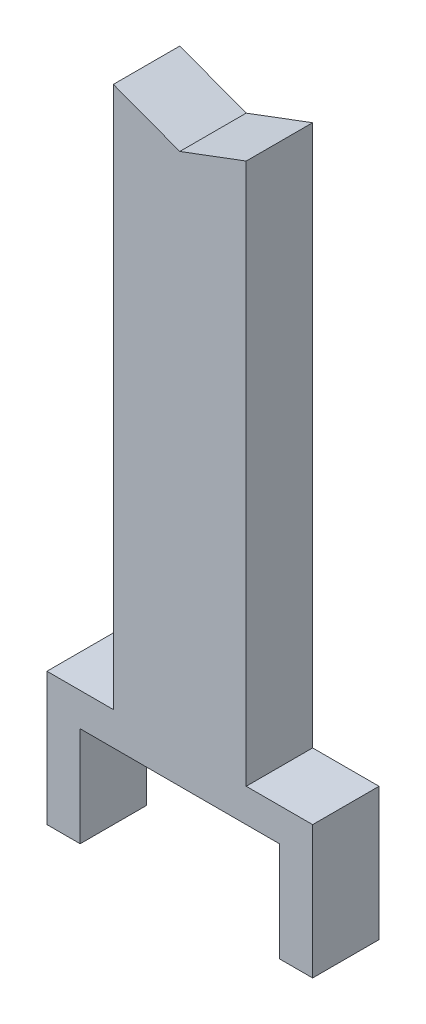
ISO-10303-21;
HEADER;
FILE_DESCRIPTION(('STEP AP214'),'2;1');
FILE_NAME('part.step','',(''),(''),'','','');
FILE_SCHEMA(('AUTOMOTIVE_DESIGN { 1 0 10303 214 1 1 1 1 }'));
ENDSEC;
DATA;
#1=APPLICATION_CONTEXT('core data for automotive mechanical design processes');
#2=APPLICATION_PROTOCOL_DEFINITION('international standard','automotive_design',2000,#1);
#3=PRODUCT_CONTEXT('',#1,'mechanical');
#4=PRODUCT('Part','Part','',(#3));
#5=PRODUCT_RELATED_PRODUCT_CATEGORY('part','',(#4));
#6=PRODUCT_DEFINITION_FORMATION('','',#4);
#7=PRODUCT_DEFINITION_CONTEXT('part definition',#1,'design');
#8=PRODUCT_DEFINITION('design','',#6,#7);
#9=PRODUCT_DEFINITION_SHAPE('','',#8);
#10=(LENGTH_UNIT() NAMED_UNIT(*) SI_UNIT(.MILLI.,.METRE.));
#11=(NAMED_UNIT(*) PLANE_ANGLE_UNIT() SI_UNIT($,.RADIAN.));
#12=(NAMED_UNIT(*) SI_UNIT($,.STERADIAN.) SOLID_ANGLE_UNIT());
#13=UNCERTAINTY_MEASURE_WITH_UNIT(LENGTH_MEASURE(1.E-05),#10,'distance_accuracy_value','');
#14=(GEOMETRIC_REPRESENTATION_CONTEXT(3) GLOBAL_UNCERTAINTY_ASSIGNED_CONTEXT((#13)) GLOBAL_UNIT_ASSIGNED_CONTEXT((#10,
#11,#12)) REPRESENTATION_CONTEXT('',''));
#15=CARTESIAN_POINT('',(0.,0.,0.));
#16=DIRECTION('',(0.,0.,1.));
#17=DIRECTION('',(1.,0.,0.));
#18=AXIS2_PLACEMENT_3D('',#15,#16,#17);
#19=CARTESIAN_POINT('',(0.,76.2,25.4));
#20=DIRECTION('',(0.,1.,0.));
#21=DIRECTION('',(-1.,0.,0.));
#22=AXIS2_PLACEMENT_3D('',#19,#20,#21);
#23=PLANE('',#22);
#24=DIRECTION('',(1.,0.,0.));
#25=VECTOR('',#24,1.);
#26=CARTESIAN_POINT('',(0.,76.2,-25.4));
#27=LINE('',#26,#25);
#28=CARTESIAN_POINT('',(-76.1999999999999,76.2,-25.4));
#29=VERTEX_POINT('',#28);
#30=CARTESIAN_POINT('',(76.2,76.2,-25.4));
#31=VERTEX_POINT('',#30);
#32=EDGE_CURVE('E174',#29,#31,#27,.T.);
#33=ORIENTED_EDGE('',*,*,#32,.T.);
#34=DIRECTION('',(0.,0.,-1.));
#35=VECTOR('',#34,1.);
#36=CARTESIAN_POINT('',(76.2,76.2,25.4));
#37=LINE('',#36,#35);
#38=CARTESIAN_POINT('',(76.2,76.2,25.4));
#39=VERTEX_POINT('',#38);
#40=EDGE_CURVE('E11',#39,#31,#37,.T.);
#41=ORIENTED_EDGE('',*,*,#40,.F.);
#42=DIRECTION('',(1.,0.,0.));
#43=VECTOR('',#42,1.);
#44=CARTESIAN_POINT('',(0.,76.2,25.4));
#45=LINE('',#44,#43);
#46=CARTESIAN_POINT('',(-76.1999999999999,76.2,25.4));
#47=VERTEX_POINT('',#46);
#48=EDGE_CURVE('E113',#47,#39,#45,.T.);
#49=ORIENTED_EDGE('',*,*,#48,.F.);
#50=DIRECTION('',(0.,0.,-1.));
#51=VECTOR('',#50,1.);
#52=CARTESIAN_POINT('',(-76.1999999999999,76.2,25.4));
#53=LINE('',#52,#51);
#54=EDGE_CURVE('E170',#47,#29,#53,.T.);
#55=ORIENTED_EDGE('',*,*,#54,.T.);
#56=EDGE_LOOP('',(#33,#41,#49,#55));
#57=FACE_BOUND('',#56,.T.);
#58=ADVANCED_FACE('F45',(#57),#23,.F.);
#59=CARTESIAN_POINT('',(76.2,0.,25.4));
#60=DIRECTION('',(-1.,0.,0.));
#61=DIRECTION('',(0.,-1.,0.));
#62=AXIS2_PLACEMENT_3D('',#59,#60,#61);
#63=PLANE('',#62);
#64=DIRECTION('',(0.,1.,0.));
#65=VECTOR('',#64,1.);
#66=CARTESIAN_POINT('',(76.2,0.,-25.4));
#67=LINE('',#66,#65);
#68=CARTESIAN_POINT('',(76.2,0.,-25.4));
#69=VERTEX_POINT('',#68);
#70=EDGE_CURVE('E178',#69,#31,#67,.T.);
#71=ORIENTED_EDGE('',*,*,#70,.F.);
#72=DIRECTION('',(0.,0.,-1.));
#73=VECTOR('',#72,1.);
#74=CARTESIAN_POINT('',(76.2,0.,25.4));
#75=LINE('',#74,#73);
#76=CARTESIAN_POINT('',(76.2,0.,25.4));
#77=VERTEX_POINT('',#76);
#78=EDGE_CURVE('E54',#77,#69,#75,.T.);
#79=ORIENTED_EDGE('',*,*,#78,.F.);
#80=DIRECTION('',(0.,1.,0.));
#81=VECTOR('',#80,1.);
#82=CARTESIAN_POINT('',(76.2,0.,25.4));
#83=LINE('',#82,#81);
#84=EDGE_CURVE('E263',#77,#39,#83,.T.);
#85=ORIENTED_EDGE('',*,*,#84,.T.);
#86=ORIENTED_EDGE('',*,*,#40,.T.);
#87=EDGE_LOOP('',(#71,#79,#85,#86));
#88=FACE_BOUND('',#87,.T.);
#89=ADVANCED_FACE('F262',(#88),#63,.T.);
#90=CARTESIAN_POINT('',(0.,0.,25.4));
#91=DIRECTION('',(0.,1.,0.));
#92=DIRECTION('',(-1.,0.,0.));
#93=AXIS2_PLACEMENT_3D('',#90,#91,#92);
#94=PLANE('',#93);
#95=DIRECTION('',(1.,0.,0.));
#96=VECTOR('',#95,1.);
#97=CARTESIAN_POINT('',(0.,0.,-25.4));
#98=LINE('',#97,#96);
#99=CARTESIAN_POINT('',(101.6,0.,-25.4));
#100=VERTEX_POINT('',#99);
#101=EDGE_CURVE('E182',#69,#100,#98,.T.);
#102=ORIENTED_EDGE('',*,*,#101,.T.);
#103=DIRECTION('',(0.,0.,-1.));
#104=VECTOR('',#103,1.);
#105=CARTESIAN_POINT('',(101.6,0.,25.4));
#106=LINE('',#105,#104);
#107=CARTESIAN_POINT('',(101.6,0.,25.4));
#108=VERTEX_POINT('',#107);
#109=EDGE_CURVE('E244',#108,#100,#106,.T.);
#110=ORIENTED_EDGE('',*,*,#109,.F.);
#111=DIRECTION('',(1.,0.,0.));
#112=VECTOR('',#111,1.);
#113=CARTESIAN_POINT('',(0.,0.,25.4));
#114=LINE('',#113,#112);
#115=EDGE_CURVE('E253',#77,#108,#114,.T.);
#116=ORIENTED_EDGE('',*,*,#115,.F.);
#117=ORIENTED_EDGE('',*,*,#78,.T.);
#118=EDGE_LOOP('',(#102,#110,#116,#117));
#119=FACE_BOUND('',#118,.T.);
#120=ADVANCED_FACE('F251',(#119),#94,.F.);
#121=CARTESIAN_POINT('',(101.6,0.,25.4));
#122=DIRECTION('',(-1.,0.,0.));
#123=DIRECTION('',(0.,-1.,0.));
#124=AXIS2_PLACEMENT_3D('',#121,#122,#123);
#125=PLANE('',#124);
#126=DIRECTION('',(0.,1.,0.));
#127=VECTOR('',#126,1.);
#128=CARTESIAN_POINT('',(101.6,0.,-25.4));
#129=LINE('',#128,#127);
#130=CARTESIAN_POINT('',(101.6,101.6,-25.4));
#131=VERTEX_POINT('',#130);
#132=EDGE_CURVE('E185',#100,#131,#129,.T.);
#133=ORIENTED_EDGE('',*,*,#132,.T.);
#134=DIRECTION('',(0.,0.,-1.));
#135=VECTOR('',#134,1.);
#136=CARTESIAN_POINT('',(101.6,101.6,25.4));
#137=LINE('',#136,#135);
#138=CARTESIAN_POINT('',(101.6,101.6,25.4));
#139=VERTEX_POINT('',#138);
#140=EDGE_CURVE('E240',#139,#131,#137,.T.);
#141=ORIENTED_EDGE('',*,*,#140,.F.);
#142=DIRECTION('',(0.,1.,0.));
#143=VECTOR('',#142,1.);
#144=CARTESIAN_POINT('',(101.6,0.,25.4));
#145=LINE('',#144,#143);
#146=EDGE_CURVE('E299',#108,#139,#145,.T.);
#147=ORIENTED_EDGE('',*,*,#146,.F.);
#148=ORIENTED_EDGE('',*,*,#109,.T.);
#149=EDGE_LOOP('',(#133,#141,#147,#148));
#150=FACE_BOUND('',#149,.T.);
#151=ADVANCED_FACE('F298',(#150),#125,.F.);
#152=CARTESIAN_POINT('',(3.88578058618806E-13,101.6,25.4));
#153=DIRECTION('',(0.,-1.,0.));
#154=DIRECTION('',(1.,0.,0.));
#155=AXIS2_PLACEMENT_3D('',#152,#153,#154);
#156=PLANE('',#155);
#157=DIRECTION('',(-1.,0.,0.));
#158=VECTOR('',#157,1.);
#159=CARTESIAN_POINT('',(3.88578058618806E-13,101.6,-25.4));
#160=LINE('',#159,#158);
#161=CARTESIAN_POINT('',(50.7999999999999,101.6,-25.4));
#162=VERTEX_POINT('',#161);
#163=EDGE_CURVE('E188',#131,#162,#160,.T.);
#164=ORIENTED_EDGE('',*,*,#163,.T.);
#165=DIRECTION('',(0.,0.,-1.));
#166=VECTOR('',#165,1.);
#167=CARTESIAN_POINT('',(50.7999999999999,101.6,25.4));
#168=LINE('',#167,#166);
#169=CARTESIAN_POINT('',(50.7999999999999,101.6,25.4));
#170=VERTEX_POINT('',#169);
#171=EDGE_CURVE('E236',#170,#162,#168,.T.);
#172=ORIENTED_EDGE('',*,*,#171,.F.);
#173=DIRECTION('',(-1.,0.,0.));
#174=VECTOR('',#173,1.);
#175=CARTESIAN_POINT('',(3.88578058618806E-13,101.6,25.4));
#176=LINE('',#175,#174);
#177=EDGE_CURVE('E294',#139,#170,#176,.T.);
#178=ORIENTED_EDGE('',*,*,#177,.F.);
#179=ORIENTED_EDGE('',*,*,#140,.T.);
#180=EDGE_LOOP('',(#164,#172,#178,#179));
#181=FACE_BOUND('',#180,.T.);
#182=ADVANCED_FACE('F293',(#181),#156,.F.);
#183=CARTESIAN_POINT('',(50.7999999999999,0.,25.4));
#184=DIRECTION('',(-1.,0.,0.));
#185=DIRECTION('',(0.,-1.,0.));
#186=AXIS2_PLACEMENT_3D('',#183,#184,#185);
#187=PLANE('',#186);
#188=DIRECTION('',(0.,1.,0.));
#189=VECTOR('',#188,1.);
#190=CARTESIAN_POINT('',(50.7999999999999,0.,-25.4));
#191=LINE('',#190,#189);
#192=CARTESIAN_POINT('',(50.8,515.747,-25.4));
#193=VERTEX_POINT('',#192);
#194=EDGE_CURVE('E191',#162,#193,#191,.T.);
#195=ORIENTED_EDGE('',*,*,#194,.T.);
#196=DIRECTION('',(0.,0.,-1.));
#197=VECTOR('',#196,1.);
#198=CARTESIAN_POINT('',(50.8,515.747,25.4));
#199=LINE('',#198,#197);
#200=CARTESIAN_POINT('',(50.8,515.747,25.4));
#201=VERTEX_POINT('',#200);
#202=EDGE_CURVE('E233',#201,#193,#199,.T.);
#203=ORIENTED_EDGE('',*,*,#202,.F.);
#204=DIRECTION('',(0.,1.,0.));
#205=VECTOR('',#204,1.);
#206=CARTESIAN_POINT('',(50.7999999999999,0.,25.4));
#207=LINE('',#206,#205);
#208=EDGE_CURVE('E290',#170,#201,#207,.T.);
#209=ORIENTED_EDGE('',*,*,#208,.F.);
#210=ORIENTED_EDGE('',*,*,#171,.T.);
#211=EDGE_LOOP('',(#195,#203,#209,#210));
#212=FACE_BOUND('',#211,.T.);
#213=ADVANCED_FACE('F288',(#212),#187,.F.);
#214=CARTESIAN_POINT('',(-163.297643835617,435.460383561644,25.4));
#215=DIRECTION('',(-0.351123441588392,0.936329177569044,0.));
#216=DIRECTION('',(-0.936329177569045,-0.351123441588392,0.));
#217=AXIS2_PLACEMENT_3D('',#214,#215,#216);
#218=PLANE('',#217);
#219=DIRECTION('',(0.936329177569045,0.351123441588392,0.));
#220=VECTOR('',#219,1.);
#221=CARTESIAN_POINT('',(-163.297643835617,435.460383561644,-25.4));
#222=LINE('',#221,#220);
#223=CARTESIAN_POINT('',(0.,496.697,-25.4));
#224=VERTEX_POINT('',#223);
#225=EDGE_CURVE('E195',#224,#193,#222,.T.);
#226=ORIENTED_EDGE('',*,*,#225,.F.);
#227=DIRECTION('',(0.,0.,-1.));
#228=VECTOR('',#227,1.);
#229=CARTESIAN_POINT('',(0.,496.697,25.4));
#230=LINE('',#229,#228);
#231=CARTESIAN_POINT('',(0.,496.697,25.4));
#232=VERTEX_POINT('',#231);
#233=EDGE_CURVE('E230',#232,#224,#230,.T.);
#234=ORIENTED_EDGE('',*,*,#233,.F.);
#235=DIRECTION('',(0.936329177569045,0.351123441588392,0.));
#236=VECTOR('',#235,1.);
#237=CARTESIAN_POINT('',(-163.297643835617,435.460383561644,25.4));
#238=LINE('',#237,#236);
#239=EDGE_CURVE('E285',#232,#201,#238,.T.);
#240=ORIENTED_EDGE('',*,*,#239,.T.);
#241=ORIENTED_EDGE('',*,*,#202,.T.);
#242=EDGE_LOOP('',(#226,#234,#240,#241));
#243=FACE_BOUND('',#242,.T.);
#244=ADVANCED_FACE('F281',(#243),#218,.T.);
#245=CARTESIAN_POINT('',(163.297643835616,435.460383561644,25.4));
#246=DIRECTION('',(0.351123441588392,0.936329177569044,0.));
#247=DIRECTION('',(-0.936329177569045,0.351123441588392,0.));
#248=AXIS2_PLACEMENT_3D('',#245,#246,#247);
#249=PLANE('',#248);
#250=DIRECTION('',(0.936329177569045,-0.351123441588392,0.));
#251=VECTOR('',#250,1.);
#252=CARTESIAN_POINT('',(163.297643835616,435.460383561644,-25.4));
#253=LINE('',#252,#251);
#254=CARTESIAN_POINT('',(-50.8,515.747,-25.4));
#255=VERTEX_POINT('',#254);
#256=EDGE_CURVE('E199',#255,#224,#253,.T.);
#257=ORIENTED_EDGE('',*,*,#256,.F.);
#258=DIRECTION('',(0.,0.,-1.));
#259=VECTOR('',#258,1.);
#260=CARTESIAN_POINT('',(-50.8,515.747,25.4));
#261=LINE('',#260,#259);
#262=CARTESIAN_POINT('',(-50.8,515.747,25.4));
#263=VERTEX_POINT('',#262);
#264=EDGE_CURVE('E227',#263,#255,#261,.T.);
#265=ORIENTED_EDGE('',*,*,#264,.F.);
#266=DIRECTION('',(0.936329177569045,-0.351123441588392,0.));
#267=VECTOR('',#266,1.);
#268=CARTESIAN_POINT('',(163.297643835616,435.460383561644,25.4));
#269=LINE('',#268,#267);
#270=EDGE_CURVE('E312',#263,#232,#269,.T.);
#271=ORIENTED_EDGE('',*,*,#270,.T.);
#272=ORIENTED_EDGE('',*,*,#233,.T.);
#273=EDGE_LOOP('',(#257,#265,#271,#272));
#274=FACE_BOUND('',#273,.T.);
#275=ADVANCED_FACE('F277',(#274),#249,.T.);
#276=CARTESIAN_POINT('',(-50.7999999999999,0.,25.4));
#277=DIRECTION('',(-1.,0.,0.));
#278=DIRECTION('',(0.,-1.,0.));
#279=AXIS2_PLACEMENT_3D('',#276,#277,#278);
#280=PLANE('',#279);
#281=DIRECTION('',(0.,1.,0.));
#282=VECTOR('',#281,1.);
#283=CARTESIAN_POINT('',(-50.7999999999999,0.,-25.4));
#284=LINE('',#283,#282);
#285=CARTESIAN_POINT('',(-50.7999999999999,101.6,-25.4));
#286=VERTEX_POINT('',#285);
#287=EDGE_CURVE('E203',#286,#255,#284,.T.);
#288=ORIENTED_EDGE('',*,*,#287,.F.);
#289=DIRECTION('',(0.,0.,-1.));
#290=VECTOR('',#289,1.);
#291=CARTESIAN_POINT('',(-50.7999999999999,101.6,25.4));
#292=LINE('',#291,#290);
#293=CARTESIAN_POINT('',(-50.7999999999999,101.6,25.4));
#294=VERTEX_POINT('',#293);
#295=EDGE_CURVE('E224',#294,#286,#292,.T.);
#296=ORIENTED_EDGE('',*,*,#295,.F.);
#297=DIRECTION('',(0.,1.,0.));
#298=VECTOR('',#297,1.);
#299=CARTESIAN_POINT('',(-50.7999999999999,0.,25.4));
#300=LINE('',#299,#298);
#301=EDGE_CURVE('E273',#294,#263,#300,.T.);
#302=ORIENTED_EDGE('',*,*,#301,.T.);
#303=ORIENTED_EDGE('',*,*,#264,.T.);
#304=EDGE_LOOP('',(#288,#296,#302,#303));
#305=FACE_BOUND('',#304,.T.);
#306=ADVANCED_FACE('F271',(#305),#280,.T.);
#307=CARTESIAN_POINT('',(0.,101.6,25.4));
#308=DIRECTION('',(0.,1.,0.));
#309=DIRECTION('',(0.,0.,1.));
#310=AXIS2_PLACEMENT_3D('',#307,#308,#309);
#311=PLANE('',#310);
#312=DIRECTION('',(1.,0.,0.));
#313=VECTOR('',#312,1.);
#314=CARTESIAN_POINT('',(0.,101.6,-25.4));
#315=LINE('',#314,#313);
#316=CARTESIAN_POINT('',(-101.6,101.6,-25.4));
#317=VERTEX_POINT('',#316);
#318=EDGE_CURVE('E207',#317,#286,#315,.T.);
#319=ORIENTED_EDGE('',*,*,#318,.F.);
#320=DIRECTION('',(0.,0.,-1.));
#321=VECTOR('',#320,1.);
#322=CARTESIAN_POINT('',(-101.6,101.6,25.4));
#323=LINE('',#322,#321);
#324=CARTESIAN_POINT('',(-101.6,101.6,25.4));
#325=VERTEX_POINT('',#324);
#326=EDGE_CURVE('E156',#325,#317,#323,.T.);
#327=ORIENTED_EDGE('',*,*,#326,.F.);
#328=DIRECTION('',(1.,0.,0.));
#329=VECTOR('',#328,1.);
#330=CARTESIAN_POINT('',(0.,101.6,25.4));
#331=LINE('',#330,#329);
#332=EDGE_CURVE('E163',#325,#294,#331,.T.);
#333=ORIENTED_EDGE('',*,*,#332,.T.);
#334=ORIENTED_EDGE('',*,*,#295,.T.);
#335=EDGE_LOOP('',(#319,#327,#333,#334));
#336=FACE_BOUND('',#335,.T.);
#337=ADVANCED_FACE('F268',(#336),#311,.T.);
#338=CARTESIAN_POINT('',(-101.6,0.,25.4));
#339=DIRECTION('',(-1.,0.,0.));
#340=DIRECTION('',(0.,0.,1.));
#341=AXIS2_PLACEMENT_3D('',#338,#339,#340);
#342=PLANE('',#341);
#343=DIRECTION('',(0.,1.,0.));
#344=VECTOR('',#343,1.);
#345=CARTESIAN_POINT('',(-101.6,0.,-25.4));
#346=LINE('',#345,#344);
#347=CARTESIAN_POINT('',(-101.6,0.,-25.4));
#348=VERTEX_POINT('',#347);
#349=EDGE_CURVE('E150',#348,#317,#346,.T.);
#350=ORIENTED_EDGE('',*,*,#349,.F.);
#351=DIRECTION('',(0.,0.,-1.));
#352=VECTOR('',#351,1.);
#353=CARTESIAN_POINT('',(-101.6,0.,25.4));
#354=LINE('',#353,#352);
#355=CARTESIAN_POINT('',(-101.6,0.,25.4));
#356=VERTEX_POINT('',#355);
#357=EDGE_CURVE('E145',#356,#348,#354,.T.);
#358=ORIENTED_EDGE('',*,*,#357,.F.);
#359=DIRECTION('',(0.,1.,0.));
#360=VECTOR('',#359,1.);
#361=CARTESIAN_POINT('',(-101.6,0.,25.4));
#362=LINE('',#361,#360);
#363=EDGE_CURVE('E148',#356,#325,#362,.T.);
#364=ORIENTED_EDGE('',*,*,#363,.T.);
#365=ORIENTED_EDGE('',*,*,#326,.T.);
#366=EDGE_LOOP('',(#350,#358,#364,#365));
#367=FACE_BOUND('',#366,.T.);
#368=ADVANCED_FACE('F147',(#367),#342,.T.);
#369=CARTESIAN_POINT('',(0.,0.,25.4));
#370=DIRECTION('',(0.,-1.,0.));
#371=DIRECTION('',(1.,0.,0.));
#372=AXIS2_PLACEMENT_3D('',#369,#370,#371);
#373=PLANE('',#372);
#374=DIRECTION('',(-1.,0.,0.));
#375=VECTOR('',#374,1.);
#376=CARTESIAN_POINT('',(0.,0.,-25.4));
#377=LINE('',#376,#375);
#378=CARTESIAN_POINT('',(-76.1999999999999,0.,-25.4));
#379=VERTEX_POINT('',#378);
#380=EDGE_CURVE('E213',#379,#348,#377,.T.);
#381=ORIENTED_EDGE('',*,*,#380,.F.);
#382=DIRECTION('',(0.,0.,-1.));
#383=VECTOR('',#382,1.);
#384=CARTESIAN_POINT('',(-76.1999999999999,0.,25.4));
#385=LINE('',#384,#383);
#386=CARTESIAN_POINT('',(-76.1999999999999,0.,25.4));
#387=VERTEX_POINT('',#386);
#388=EDGE_CURVE('E104',#387,#379,#385,.T.);
#389=ORIENTED_EDGE('',*,*,#388,.F.);
#390=DIRECTION('',(-1.,0.,0.));
#391=VECTOR('',#390,1.);
#392=CARTESIAN_POINT('',(0.,0.,25.4));
#393=LINE('',#392,#391);
#394=EDGE_CURVE('E160',#387,#356,#393,.T.);
#395=ORIENTED_EDGE('',*,*,#394,.T.);
#396=ORIENTED_EDGE('',*,*,#357,.T.);
#397=EDGE_LOOP('',(#381,#389,#395,#396));
#398=FACE_BOUND('',#397,.T.);
#399=ADVANCED_FACE('F166',(#398),#373,.T.);
#400=CARTESIAN_POINT('',(-76.1999999999999,0.,25.4));
#401=DIRECTION('',(-1.,0.,0.));
#402=DIRECTION('',(0.,-1.,0.));
#403=AXIS2_PLACEMENT_3D('',#400,#401,#402);
#404=PLANE('',#403);
#405=DIRECTION('',(0.,1.,0.));
#406=VECTOR('',#405,1.);
#407=CARTESIAN_POINT('',(-76.1999999999999,0.,-25.4));
#408=LINE('',#407,#406);
#409=EDGE_CURVE('E107',#379,#29,#408,.T.);
#410=ORIENTED_EDGE('',*,*,#409,.T.);
#411=ORIENTED_EDGE('',*,*,#54,.F.);
#412=DIRECTION('',(0.,1.,0.));
#413=VECTOR('',#412,1.);
#414=CARTESIAN_POINT('',(-76.1999999999999,0.,25.4));
#415=LINE('',#414,#413);
#416=EDGE_CURVE('E62',#387,#47,#415,.T.);
#417=ORIENTED_EDGE('',*,*,#416,.F.);
#418=ORIENTED_EDGE('',*,*,#388,.T.);
#419=EDGE_LOOP('',(#410,#411,#417,#418));
#420=FACE_BOUND('',#419,.T.);
#421=ADVANCED_FACE('F414',(#420),#404,.F.);
#422=CARTESIAN_POINT('',(0.,0.,25.4));
#423=DIRECTION('',(0.,0.,1.));
#424=DIRECTION('',(1.,0.,0.));
#425=AXIS2_PLACEMENT_3D('',#422,#423,#424);
#426=PLANE('',#425);
#427=ORIENTED_EDGE('',*,*,#48,.T.);
#428=ORIENTED_EDGE('',*,*,#84,.F.);
#429=ORIENTED_EDGE('',*,*,#115,.T.);
#430=ORIENTED_EDGE('',*,*,#146,.T.);
#431=ORIENTED_EDGE('',*,*,#177,.T.);
#432=ORIENTED_EDGE('',*,*,#208,.T.);
#433=ORIENTED_EDGE('',*,*,#239,.F.);
#434=ORIENTED_EDGE('',*,*,#270,.F.);
#435=ORIENTED_EDGE('',*,*,#301,.F.);
#436=ORIENTED_EDGE('',*,*,#332,.F.);
#437=ORIENTED_EDGE('',*,*,#363,.F.);
#438=ORIENTED_EDGE('',*,*,#394,.F.);
#439=ORIENTED_EDGE('',*,*,#416,.T.);
#440=EDGE_LOOP('',(#427,#428,#429,#430,#431,#432,#433,#434,#435,#436,#437,#438,#439));
#441=FACE_BOUND('',#440,.T.);
#442=ADVANCED_FACE('F159',(#441),#426,.T.);
#443=CARTESIAN_POINT('',(0.,0.,-25.4));
#444=DIRECTION('',(0.,0.,1.));
#445=DIRECTION('',(1.,0.,0.));
#446=AXIS2_PLACEMENT_3D('',#443,#444,#445);
#447=PLANE('',#446);
#448=ORIENTED_EDGE('',*,*,#32,.F.);
#449=ORIENTED_EDGE('',*,*,#409,.F.);
#450=ORIENTED_EDGE('',*,*,#380,.T.);
#451=ORIENTED_EDGE('',*,*,#349,.T.);
#452=ORIENTED_EDGE('',*,*,#318,.T.);
#453=ORIENTED_EDGE('',*,*,#287,.T.);
#454=ORIENTED_EDGE('',*,*,#256,.T.);
#455=ORIENTED_EDGE('',*,*,#225,.T.);
#456=ORIENTED_EDGE('',*,*,#194,.F.);
#457=ORIENTED_EDGE('',*,*,#163,.F.);
#458=ORIENTED_EDGE('',*,*,#132,.F.);
#459=ORIENTED_EDGE('',*,*,#101,.F.);
#460=ORIENTED_EDGE('',*,*,#70,.T.);
#461=EDGE_LOOP('',(#448,#449,#450,#451,#452,#453,#454,#455,#456,#457,#458,#459,#460));
#462=FACE_BOUND('',#461,.T.);
#463=ADVANCED_FACE('F260',(#462),#447,.F.);
#464=CLOSED_SHELL('',(#58,#89,#120,#151,#182,#213,#244,#275,#306,#337,#368,#399,#421,#442,#463));
#465=MANIFOLD_SOLID_BREP('B2',#464);
#466=ADVANCED_BREP_SHAPE_REPRESENTATION('',(#18,#465),#14);
#467=SHAPE_DEFINITION_REPRESENTATION(#9,#466);
ENDSEC;
END-ISO-10303-21;
